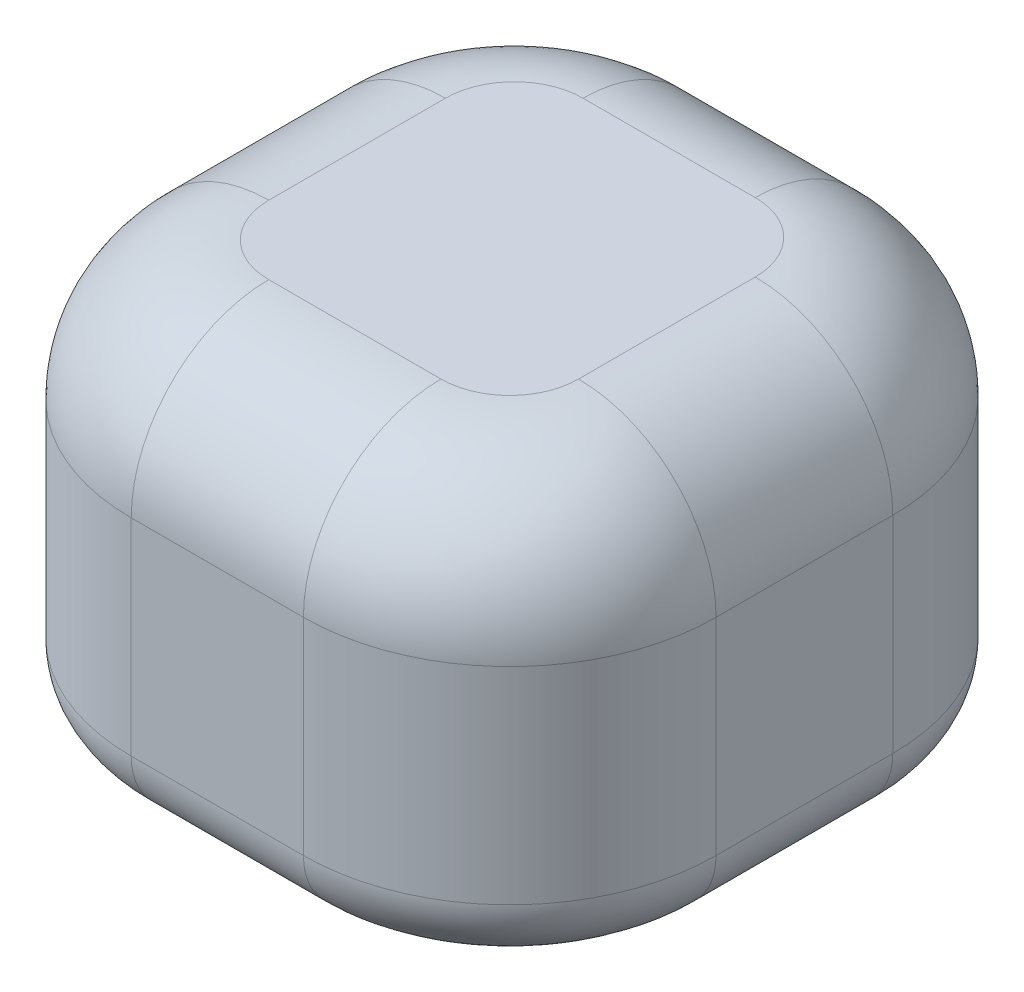
ISO-10303-21;
HEADER;
FILE_DESCRIPTION(('STEP AP214'),'2;1');
FILE_NAME('part.step','',(''),(''),'','','');
FILE_SCHEMA(('AUTOMOTIVE_DESIGN { 1 0 10303 214 1 1 1 1 }'));
ENDSEC;
DATA;
#1=APPLICATION_CONTEXT('core data for automotive mechanical design processes');
#2=APPLICATION_PROTOCOL_DEFINITION('international standard','automotive_design',2000,#1);
#3=PRODUCT_CONTEXT('',#1,'mechanical');
#4=PRODUCT('Part','Part','',(#3));
#5=PRODUCT_RELATED_PRODUCT_CATEGORY('part','',(#4));
#6=PRODUCT_DEFINITION_FORMATION('','',#4);
#7=PRODUCT_DEFINITION_CONTEXT('part definition',#1,'design');
#8=PRODUCT_DEFINITION('design','',#6,#7);
#9=PRODUCT_DEFINITION_SHAPE('','',#8);
#10=(LENGTH_UNIT() NAMED_UNIT(*) SI_UNIT(.MILLI.,.METRE.));
#11=(NAMED_UNIT(*) PLANE_ANGLE_UNIT() SI_UNIT($,.RADIAN.));
#12=(NAMED_UNIT(*) SI_UNIT($,.STERADIAN.) SOLID_ANGLE_UNIT());
#13=UNCERTAINTY_MEASURE_WITH_UNIT(LENGTH_MEASURE(1.E-05),#10,'distance_accuracy_value','');
#14=(GEOMETRIC_REPRESENTATION_CONTEXT(3) GLOBAL_UNCERTAINTY_ASSIGNED_CONTEXT((#13)) GLOBAL_UNIT_ASSIGNED_CONTEXT((#10,
#11,#12)) REPRESENTATION_CONTEXT('',''));
#15=CARTESIAN_POINT('',(0.,0.,0.));
#16=DIRECTION('',(0.,0.,1.));
#17=DIRECTION('',(1.,0.,0.));
#18=AXIS2_PLACEMENT_3D('',#15,#16,#17);
#19=CARTESIAN_POINT('',(42.5199767046538,-30.,42.8475881225822));
#20=DIRECTION('',(1.,0.,0.));
#21=DIRECTION('',(0.,0.,-1.));
#22=AXIS2_PLACEMENT_3D('',#19,#20,#21);
#23=PLANE('',#22);
#24=DIRECTION('',(0.,1.,0.));
#25=VECTOR('',#24,1.);
#26=CARTESIAN_POINT('',(42.5199767046538,-30.,12.8475881225822));
#27=LINE('',#26,#25);
#28=CARTESIAN_POINT('',(42.5199767046538,10.,12.8475881225822));
#29=VERTEX_POINT('',#28);
#30=CARTESIAN_POINT('',(42.5199767046538,-20.,12.8475881225822));
#31=VERTEX_POINT('',#30);
#32=EDGE_CURVE('E293',#29,#31,#27,.F.);
#33=ORIENTED_EDGE('',*,*,#32,.T.);
#34=DIRECTION('',(0.,0.,-1.));
#35=VECTOR('',#34,1.);
#36=CARTESIAN_POINT('',(42.5199767046538,-20.,42.8475881225822));
#37=LINE('',#36,#35);
#38=CARTESIAN_POINT('',(42.5199767046538,-20.,-12.8475881225822));
#39=VERTEX_POINT('',#38);
#40=EDGE_CURVE('E11',#31,#39,#37,.T.);
#41=ORIENTED_EDGE('',*,*,#40,.T.);
#42=DIRECTION('',(0.,1.,0.));
#43=VECTOR('',#42,1.);
#44=CARTESIAN_POINT('',(42.5199767046538,-30.,-12.8475881225822));
#45=LINE('',#44,#43);
#46=CARTESIAN_POINT('',(42.5199767046538,10.,-12.8475881225822));
#47=VERTEX_POINT('',#46);
#48=EDGE_CURVE('E289',#39,#47,#45,.T.);
#49=ORIENTED_EDGE('',*,*,#48,.T.);
#50=DIRECTION('',(0.,0.,-1.));
#51=VECTOR('',#50,1.);
#52=CARTESIAN_POINT('',(42.5199767046538,10.,12.8475881225822));
#53=LINE('',#52,#51);
#54=EDGE_CURVE('E197',#47,#29,#53,.F.);
#55=ORIENTED_EDGE('',*,*,#54,.T.);
#56=EDGE_LOOP('',(#33,#41,#49,#55));
#57=FACE_BOUND('',#56,.T.);
#58=ADVANCED_FACE('F39',(#57),#23,.T.);
#59=CARTESIAN_POINT('',(-42.5199767046538,-30.,42.8475881225822));
#60=DIRECTION('',(0.,0.,1.));
#61=DIRECTION('',(1.,0.,0.));
#62=AXIS2_PLACEMENT_3D('',#59,#60,#61);
#63=PLANE('',#62);
#64=DIRECTION('',(0.,1.,0.));
#65=VECTOR('',#64,1.);
#66=CARTESIAN_POINT('',(-12.5199767046538,-30.,42.8475881225822));
#67=LINE('',#66,#65);
#68=CARTESIAN_POINT('',(-12.5199767046538,10.,42.8475881225822));
#69=VERTEX_POINT('',#68);
#70=CARTESIAN_POINT('',(-12.5199767046538,-20.,42.8475881225822));
#71=VERTEX_POINT('',#70);
#72=EDGE_CURVE('E222',#69,#71,#67,.F.);
#73=ORIENTED_EDGE('',*,*,#72,.T.);
#74=DIRECTION('',(1.,0.,0.));
#75=VECTOR('',#74,1.);
#76=CARTESIAN_POINT('',(-42.5199767046538,-20.,42.8475881225822));
#77=LINE('',#76,#75);
#78=CARTESIAN_POINT('',(12.5199767046538,-20.,42.8475881225822));
#79=VERTEX_POINT('',#78);
#80=EDGE_CURVE('E63',#71,#79,#77,.T.);
#81=ORIENTED_EDGE('',*,*,#80,.T.);
#82=DIRECTION('',(0.,1.,0.));
#83=VECTOR('',#82,1.);
#84=CARTESIAN_POINT('',(12.5199767046538,-30.,42.8475881225822));
#85=LINE('',#84,#83);
#86=CARTESIAN_POINT('',(12.5199767046538,10.,42.8475881225822));
#87=VERTEX_POINT('',#86);
#88=EDGE_CURVE('E287',#79,#87,#85,.T.);
#89=ORIENTED_EDGE('',*,*,#88,.T.);
#90=DIRECTION('',(1.,0.,0.));
#91=VECTOR('',#90,1.);
#92=CARTESIAN_POINT('',(-12.5199767046538,10.,42.8475881225822));
#93=LINE('',#92,#91);
#94=EDGE_CURVE('E202',#87,#69,#93,.F.);
#95=ORIENTED_EDGE('',*,*,#94,.T.);
#96=EDGE_LOOP('',(#73,#81,#89,#95));
#97=FACE_BOUND('',#96,.T.);
#98=ADVANCED_FACE('F286',(#97),#63,.T.);
#99=CARTESIAN_POINT('',(-42.5199767046538,-30.,42.8475881225822));
#100=DIRECTION('',(-1.,0.,0.));
#101=DIRECTION('',(0.,0.,1.));
#102=AXIS2_PLACEMENT_3D('',#99,#100,#101);
#103=PLANE('',#102);
#104=DIRECTION('',(0.,1.,0.));
#105=VECTOR('',#104,1.);
#106=CARTESIAN_POINT('',(-42.5199767046538,-30.,-12.8475881225822));
#107=LINE('',#106,#105);
#108=CARTESIAN_POINT('',(-42.5199767046538,10.,-12.8475881225822));
#109=VERTEX_POINT('',#108);
#110=CARTESIAN_POINT('',(-42.5199767046538,-20.,-12.8475881225822));
#111=VERTEX_POINT('',#110);
#112=EDGE_CURVE('E300',#109,#111,#107,.F.);
#113=ORIENTED_EDGE('',*,*,#112,.T.);
#114=DIRECTION('',(0.,0.,1.));
#115=VECTOR('',#114,1.);
#116=CARTESIAN_POINT('',(-42.5199767046538,-20.,42.8475881225822));
#117=LINE('',#116,#115);
#118=CARTESIAN_POINT('',(-42.5199767046538,-20.,12.8475881225822));
#119=VERTEX_POINT('',#118);
#120=EDGE_CURVE('E246',#111,#119,#117,.T.);
#121=ORIENTED_EDGE('',*,*,#120,.T.);
#122=DIRECTION('',(0.,1.,0.));
#123=VECTOR('',#122,1.);
#124=CARTESIAN_POINT('',(-42.5199767046538,-30.,12.8475881225822));
#125=LINE('',#124,#123);
#126=CARTESIAN_POINT('',(-42.5199767046538,10.,12.8475881225822));
#127=VERTEX_POINT('',#126);
#128=EDGE_CURVE('E175',#119,#127,#125,.T.);
#129=ORIENTED_EDGE('',*,*,#128,.T.);
#130=DIRECTION('',(0.,0.,1.));
#131=VECTOR('',#130,1.);
#132=CARTESIAN_POINT('',(-42.5199767046538,10.,-12.8475881225822));
#133=LINE('',#132,#131);
#134=EDGE_CURVE('E182',#127,#109,#133,.F.);
#135=ORIENTED_EDGE('',*,*,#134,.T.);
#136=EDGE_LOOP('',(#113,#121,#129,#135));
#137=FACE_BOUND('',#136,.T.);
#138=ADVANCED_FACE('F322',(#137),#103,.T.);
#139=CARTESIAN_POINT('',(-42.5199767046538,-30.,-42.8475881225822));
#140=DIRECTION('',(0.,0.,-1.));
#141=DIRECTION('',(-1.,0.,0.));
#142=AXIS2_PLACEMENT_3D('',#139,#140,#141);
#143=PLANE('',#142);
#144=DIRECTION('',(0.,1.,0.));
#145=VECTOR('',#144,1.);
#146=CARTESIAN_POINT('',(12.5199767046538,-30.,-42.8475881225822));
#147=LINE('',#146,#145);
#148=CARTESIAN_POINT('',(12.5199767046538,10.,-42.8475881225822));
#149=VERTEX_POINT('',#148);
#150=CARTESIAN_POINT('',(12.5199767046538,-20.,-42.8475881225822));
#151=VERTEX_POINT('',#150);
#152=EDGE_CURVE('E297',#149,#151,#147,.F.);
#153=ORIENTED_EDGE('',*,*,#152,.T.);
#154=DIRECTION('',(-1.,0.,0.));
#155=VECTOR('',#154,1.);
#156=CARTESIAN_POINT('',(-42.5199767046538,-20.,-42.8475881225822));
#157=LINE('',#156,#155);
#158=CARTESIAN_POINT('',(-12.5199767046538,-20.,-42.8475881225822));
#159=VERTEX_POINT('',#158);
#160=EDGE_CURVE('E242',#151,#159,#157,.T.);
#161=ORIENTED_EDGE('',*,*,#160,.T.);
#162=DIRECTION('',(0.,1.,0.));
#163=VECTOR('',#162,1.);
#164=CARTESIAN_POINT('',(-12.5199767046538,-30.,-42.8475881225822));
#165=LINE('',#164,#163);
#166=CARTESIAN_POINT('',(-12.5199767046538,10.,-42.8475881225822));
#167=VERTEX_POINT('',#166);
#168=EDGE_CURVE('E295',#159,#167,#165,.T.);
#169=ORIENTED_EDGE('',*,*,#168,.T.);
#170=DIRECTION('',(-1.,0.,0.));
#171=VECTOR('',#170,1.);
#172=CARTESIAN_POINT('',(12.5199767046538,10.,-42.8475881225822));
#173=LINE('',#172,#171);
#174=EDGE_CURVE('E192',#167,#149,#173,.F.);
#175=ORIENTED_EDGE('',*,*,#174,.T.);
#176=EDGE_LOOP('',(#153,#161,#169,#175));
#177=FACE_BOUND('',#176,.T.);
#178=ADVANCED_FACE('F376',(#177),#143,.T.);
#179=CARTESIAN_POINT('',(0.,-30.,0.));
#180=DIRECTION('',(0.,-1.,0.));
#181=DIRECTION('',(0.,0.,-1.));
#182=AXIS2_PLACEMENT_3D('',#179,#180,#181);
#183=PLANE('',#182);
#184=DIRECTION('',(-1.,0.,0.));
#185=VECTOR('',#184,1.);
#186=CARTESIAN_POINT('',(0.,-30.,-32.8475881225822));
#187=LINE('',#186,#185);
#188=CARTESIAN_POINT('',(-12.5199767046538,-30.,-32.8475881225822));
#189=VERTEX_POINT('',#188);
#190=CARTESIAN_POINT('',(12.5199767046538,-30.,-32.8475881225822));
#191=VERTEX_POINT('',#190);
#192=EDGE_CURVE('E234',#189,#191,#187,.F.);
#193=ORIENTED_EDGE('',*,*,#192,.T.);
#194=CARTESIAN_POINT('',(12.5199767046538,-30.,-12.8475881225822));
#195=DIRECTION('',(0.,-1.,0.));
#196=DIRECTION('',(0.,0.,-1.));
#197=AXIS2_PLACEMENT_3D('',#194,#195,#196);
#198=CIRCLE('',#197,20.);
#199=CARTESIAN_POINT('',(32.5199767046538,-30.,-12.8475881225822));
#200=VERTEX_POINT('',#199);
#201=EDGE_CURVE('E236',#191,#200,#198,.T.);
#202=ORIENTED_EDGE('',*,*,#201,.T.);
#203=DIRECTION('',(0.,0.,-1.));
#204=VECTOR('',#203,1.);
#205=CARTESIAN_POINT('',(32.5199767046538,-30.,0.));
#206=LINE('',#205,#204);
#207=CARTESIAN_POINT('',(32.5199767046538,-30.,12.8475881225822));
#208=VERTEX_POINT('',#207);
#209=EDGE_CURVE('E203',#200,#208,#206,.F.);
#210=ORIENTED_EDGE('',*,*,#209,.T.);
#211=CARTESIAN_POINT('',(12.5199767046538,-30.,12.8475881225822));
#212=DIRECTION('',(0.,-1.,0.));
#213=DIRECTION('',(0.,0.,-1.));
#214=AXIS2_PLACEMENT_3D('',#211,#212,#213);
#215=CIRCLE('',#214,20.);
#216=CARTESIAN_POINT('',(12.5199767046538,-30.,32.8475881225822));
#217=VERTEX_POINT('',#216);
#218=EDGE_CURVE('E224',#208,#217,#215,.T.);
#219=ORIENTED_EDGE('',*,*,#218,.T.);
#220=DIRECTION('',(1.,0.,0.));
#221=VECTOR('',#220,1.);
#222=CARTESIAN_POINT('',(0.,-30.,32.8475881225822));
#223=LINE('',#222,#221);
#224=CARTESIAN_POINT('',(-12.5199767046538,-30.,32.8475881225822));
#225=VERTEX_POINT('',#224);
#226=EDGE_CURVE('E226',#217,#225,#223,.F.);
#227=ORIENTED_EDGE('',*,*,#226,.T.);
#228=CARTESIAN_POINT('',(-12.5199767046538,-30.,12.8475881225822));
#229=DIRECTION('',(0.,-1.,0.));
#230=DIRECTION('',(0.,0.,-1.));
#231=AXIS2_PLACEMENT_3D('',#228,#229,#230);
#232=CIRCLE('',#231,20.);
#233=CARTESIAN_POINT('',(-32.5199767046538,-30.,12.8475881225822));
#234=VERTEX_POINT('',#233);
#235=EDGE_CURVE('E228',#225,#234,#232,.T.);
#236=ORIENTED_EDGE('',*,*,#235,.T.);
#237=DIRECTION('',(0.,0.,1.));
#238=VECTOR('',#237,1.);
#239=CARTESIAN_POINT('',(-32.5199767046538,-30.,0.));
#240=LINE('',#239,#238);
#241=CARTESIAN_POINT('',(-32.5199767046538,-30.,-12.8475881225822));
#242=VERTEX_POINT('',#241);
#243=EDGE_CURVE('E230',#234,#242,#240,.F.);
#244=ORIENTED_EDGE('',*,*,#243,.T.);
#245=CARTESIAN_POINT('',(-12.5199767046538,-30.,-12.8475881225822));
#246=DIRECTION('',(0.,-1.,0.));
#247=DIRECTION('',(0.,0.,-1.));
#248=AXIS2_PLACEMENT_3D('',#245,#246,#247);
#249=CIRCLE('',#248,20.);
#250=EDGE_CURVE('E232',#242,#189,#249,.T.);
#251=ORIENTED_EDGE('',*,*,#250,.T.);
#252=EDGE_LOOP('',(#193,#202,#210,#219,#227,#236,#244,#251));
#253=FACE_BOUND('',#252,.T.);
#254=ADVANCED_FACE('F339',(#253),#183,.T.);
#255=CARTESIAN_POINT('',(0.,30.,0.));
#256=DIRECTION('',(0.,-1.,0.));
#257=DIRECTION('',(0.,0.,-1.));
#258=AXIS2_PLACEMENT_3D('',#255,#256,#257);
#259=PLANE('',#258);
#260=DIRECTION('',(0.,0.,1.));
#261=VECTOR('',#260,1.);
#262=CARTESIAN_POINT('',(-22.5199767046538,30.,12.8475881225822));
#263=LINE('',#262,#261);
#264=CARTESIAN_POINT('',(-22.5199767046538,30.,-12.8475881225822));
#265=VERTEX_POINT('',#264);
#266=CARTESIAN_POINT('',(-22.5199767046538,30.,12.8475881225822));
#267=VERTEX_POINT('',#266);
#268=EDGE_CURVE('E179',#265,#267,#263,.T.);
#269=ORIENTED_EDGE('',*,*,#268,.T.);
#270=CARTESIAN_POINT('',(-12.5199767046538,30.,12.8475881225822));
#271=DIRECTION('',(0.,-1.,0.));
#272=DIRECTION('',(0.,0.,-1.));
#273=AXIS2_PLACEMENT_3D('',#270,#271,#272);
#274=CIRCLE('',#273,10.);
#275=CARTESIAN_POINT('',(-12.5199767046538,30.,22.8475881225822));
#276=VERTEX_POINT('',#275);
#277=EDGE_CURVE('E160',#267,#276,#274,.F.);
#278=ORIENTED_EDGE('',*,*,#277,.T.);
#279=DIRECTION('',(1.,0.,0.));
#280=VECTOR('',#279,1.);
#281=CARTESIAN_POINT('',(12.5199767046538,30.,22.8475881225822));
#282=LINE('',#281,#280);
#283=CARTESIAN_POINT('',(12.5199767046538,30.,22.8475881225822));
#284=VERTEX_POINT('',#283);
#285=EDGE_CURVE('E168',#276,#284,#282,.T.);
#286=ORIENTED_EDGE('',*,*,#285,.T.);
#287=CARTESIAN_POINT('',(12.5199767046538,30.,12.8475881225822));
#288=DIRECTION('',(0.,-1.,0.));
#289=DIRECTION('',(0.,0.,-1.));
#290=AXIS2_PLACEMENT_3D('',#287,#288,#289);
#291=CIRCLE('',#290,10.);
#292=CARTESIAN_POINT('',(22.5199767046538,30.,12.8475881225822));
#293=VERTEX_POINT('',#292);
#294=EDGE_CURVE('E174',#284,#293,#291,.F.);
#295=ORIENTED_EDGE('',*,*,#294,.T.);
#296=DIRECTION('',(0.,0.,-1.));
#297=VECTOR('',#296,1.);
#298=CARTESIAN_POINT('',(22.5199767046538,30.,-12.8475881225822));
#299=LINE('',#298,#297);
#300=CARTESIAN_POINT('',(22.5199767046538,30.,-12.8475881225822));
#301=VERTEX_POINT('',#300);
#302=EDGE_CURVE('E305',#293,#301,#299,.T.);
#303=ORIENTED_EDGE('',*,*,#302,.T.);
#304=CARTESIAN_POINT('',(12.5199767046538,30.,-12.8475881225822));
#305=DIRECTION('',(0.,-1.,0.));
#306=DIRECTION('',(0.,0.,-1.));
#307=AXIS2_PLACEMENT_3D('',#304,#305,#306);
#308=CIRCLE('',#307,10.);
#309=CARTESIAN_POINT('',(12.5199767046538,30.,-22.8475881225822));
#310=VERTEX_POINT('',#309);
#311=EDGE_CURVE('E307',#301,#310,#308,.F.);
#312=ORIENTED_EDGE('',*,*,#311,.T.);
#313=DIRECTION('',(-1.,0.,0.));
#314=VECTOR('',#313,1.);
#315=CARTESIAN_POINT('',(-12.5199767046538,30.,-22.8475881225822));
#316=LINE('',#315,#314);
#317=CARTESIAN_POINT('',(-12.5199767046538,30.,-22.8475881225822));
#318=VERTEX_POINT('',#317);
#319=EDGE_CURVE('E309',#310,#318,#316,.T.);
#320=ORIENTED_EDGE('',*,*,#319,.T.);
#321=CARTESIAN_POINT('',(-12.5199767046538,30.,-12.8475881225822));
#322=DIRECTION('',(0.,-1.,0.));
#323=DIRECTION('',(0.,0.,-1.));
#324=AXIS2_PLACEMENT_3D('',#321,#322,#323);
#325=CIRCLE('',#324,10.);
#326=EDGE_CURVE('E184',#318,#265,#325,.F.);
#327=ORIENTED_EDGE('',*,*,#326,.T.);
#328=EDGE_LOOP('',(#269,#278,#286,#295,#303,#312,#320,#327));
#329=FACE_BOUND('',#328,.T.);
#330=ADVANCED_FACE('F177',(#329),#259,.F.);
#331=CARTESIAN_POINT('',(12.5199767046538,-30.,12.8475881225822));
#332=DIRECTION('',(0.,1.,0.));
#333=DIRECTION('',(0.,0.,1.));
#334=AXIS2_PLACEMENT_3D('',#331,#332,#333);
#335=CYLINDRICAL_SURFACE('',#334,30.);
#336=ORIENTED_EDGE('',*,*,#88,.F.);
#337=CARTESIAN_POINT('',(12.5199767046538,-20.,12.8475881225822));
#338=DIRECTION('',(0.,-1.,0.));
#339=DIRECTION('',(0.,0.,-1.));
#340=AXIS2_PLACEMENT_3D('',#337,#338,#339);
#341=CIRCLE('',#340,30.);
#342=EDGE_CURVE('E48',#79,#31,#341,.F.);
#343=ORIENTED_EDGE('',*,*,#342,.T.);
#344=ORIENTED_EDGE('',*,*,#32,.F.);
#345=CARTESIAN_POINT('',(12.5199767046538,10.,12.8475881225822));
#346=DIRECTION('',(0.,-1.,0.));
#347=DIRECTION('',(0.,0.,-1.));
#348=AXIS2_PLACEMENT_3D('',#345,#346,#347);
#349=CIRCLE('',#348,30.);
#350=EDGE_CURVE('E199',#29,#87,#349,.T.);
#351=ORIENTED_EDGE('',*,*,#350,.T.);
#352=EDGE_LOOP('',(#336,#343,#344,#351));
#353=FACE_BOUND('',#352,.T.);
#354=ADVANCED_FACE('F378',(#353),#335,.T.);
#355=CARTESIAN_POINT('',(12.5199767046538,-30.,-12.8475881225822));
#356=DIRECTION('',(0.,1.,0.));
#357=DIRECTION('',(0.,0.,1.));
#358=AXIS2_PLACEMENT_3D('',#355,#356,#357);
#359=CYLINDRICAL_SURFACE('',#358,30.);
#360=ORIENTED_EDGE('',*,*,#48,.F.);
#361=CARTESIAN_POINT('',(12.5199767046538,-20.,-12.8475881225822));
#362=DIRECTION('',(0.,-1.,0.));
#363=DIRECTION('',(0.,0.,-1.));
#364=AXIS2_PLACEMENT_3D('',#361,#362,#363);
#365=CIRCLE('',#364,30.);
#366=EDGE_CURVE('E239',#39,#151,#365,.F.);
#367=ORIENTED_EDGE('',*,*,#366,.T.);
#368=ORIENTED_EDGE('',*,*,#152,.F.);
#369=CARTESIAN_POINT('',(12.5199767046538,10.,-12.8475881225822));
#370=DIRECTION('',(0.,-1.,0.));
#371=DIRECTION('',(0.,0.,-1.));
#372=AXIS2_PLACEMENT_3D('',#369,#370,#371);
#373=CIRCLE('',#372,30.);
#374=EDGE_CURVE('E194',#149,#47,#373,.T.);
#375=ORIENTED_EDGE('',*,*,#374,.T.);
#376=EDGE_LOOP('',(#360,#367,#368,#375));
#377=FACE_BOUND('',#376,.T.);
#378=ADVANCED_FACE('F355',(#377),#359,.T.);
#379=CARTESIAN_POINT('',(-12.5199767046538,-30.,12.8475881225822));
#380=DIRECTION('',(0.,1.,0.));
#381=DIRECTION('',(0.,0.,1.));
#382=AXIS2_PLACEMENT_3D('',#379,#380,#381);
#383=CYLINDRICAL_SURFACE('',#382,30.);
#384=ORIENTED_EDGE('',*,*,#128,.F.);
#385=CARTESIAN_POINT('',(-12.5199767046538,-20.,12.8475881225822));
#386=DIRECTION('',(0.,-1.,0.));
#387=DIRECTION('',(0.,0.,-1.));
#388=AXIS2_PLACEMENT_3D('',#385,#386,#387);
#389=CIRCLE('',#388,30.);
#390=EDGE_CURVE('E248',#119,#71,#389,.F.);
#391=ORIENTED_EDGE('',*,*,#390,.T.);
#392=ORIENTED_EDGE('',*,*,#72,.F.);
#393=CARTESIAN_POINT('',(-12.5199767046538,10.,12.8475881225822));
#394=DIRECTION('',(0.,-1.,0.));
#395=DIRECTION('',(0.,0.,-1.));
#396=AXIS2_PLACEMENT_3D('',#393,#394,#395);
#397=CIRCLE('',#396,30.);
#398=EDGE_CURVE('E162',#69,#127,#397,.T.);
#399=ORIENTED_EDGE('',*,*,#398,.T.);
#400=EDGE_LOOP('',(#384,#391,#392,#399));
#401=FACE_BOUND('',#400,.T.);
#402=ADVANCED_FACE('F285',(#401),#383,.T.);
#403=CARTESIAN_POINT('',(-12.5199767046538,-30.,-12.8475881225822));
#404=DIRECTION('',(0.,1.,0.));
#405=DIRECTION('',(0.,0.,1.));
#406=AXIS2_PLACEMENT_3D('',#403,#404,#405);
#407=CYLINDRICAL_SURFACE('',#406,30.);
#408=ORIENTED_EDGE('',*,*,#168,.F.);
#409=CARTESIAN_POINT('',(-12.5199767046538,-20.,-12.8475881225822));
#410=DIRECTION('',(0.,-1.,0.));
#411=DIRECTION('',(0.,0.,-1.));
#412=AXIS2_PLACEMENT_3D('',#409,#410,#411);
#413=CIRCLE('',#412,30.);
#414=EDGE_CURVE('E244',#159,#111,#413,.F.);
#415=ORIENTED_EDGE('',*,*,#414,.T.);
#416=ORIENTED_EDGE('',*,*,#112,.F.);
#417=CARTESIAN_POINT('',(-12.5199767046538,10.,-12.8475881225822));
#418=DIRECTION('',(0.,-1.,0.));
#419=DIRECTION('',(0.,0.,-1.));
#420=AXIS2_PLACEMENT_3D('',#417,#418,#419);
#421=CIRCLE('',#420,30.);
#422=EDGE_CURVE('E189',#109,#167,#421,.T.);
#423=ORIENTED_EDGE('',*,*,#422,.T.);
#424=EDGE_LOOP('',(#408,#415,#416,#423));
#425=FACE_BOUND('',#424,.T.);
#426=ADVANCED_FACE('F325',(#425),#407,.T.);
#427=CARTESIAN_POINT('',(12.5199767046538,10.,-12.8475881225822));
#428=DIRECTION('',(0.,-1.,0.));
#429=DIRECTION('',(0.,0.,-1.));
#430=AXIS2_PLACEMENT_3D('',#427,#428,#429);
#431=DEGENERATE_TOROIDAL_SURFACE('',#430,10.,20.,.T.);
#432=CARTESIAN_POINT('',(22.5199767046538,10.,-12.8475881225822));
#433=DIRECTION('',(0.,0.,1.));
#434=DIRECTION('',(1.,0.,0.));
#435=AXIS2_PLACEMENT_3D('',#432,#433,#434);
#436=CIRCLE('',#435,20.);
#437=EDGE_CURVE('E216',#47,#301,#436,.T.);
#438=ORIENTED_EDGE('',*,*,#437,.F.);
#439=ORIENTED_EDGE('',*,*,#374,.F.);
#440=CARTESIAN_POINT('',(12.5199767046538,10.,-22.8475881225822));
#441=DIRECTION('',(-1.,0.,0.));
#442=DIRECTION('',(0.,0.,1.));
#443=AXIS2_PLACEMENT_3D('',#440,#441,#442);
#444=CIRCLE('',#443,20.);
#445=EDGE_CURVE('E219',#310,#149,#444,.T.);
#446=ORIENTED_EDGE('',*,*,#445,.F.);
#447=ORIENTED_EDGE('',*,*,#311,.F.);
#448=EDGE_LOOP('',(#438,#439,#446,#447));
#449=FACE_BOUND('',#448,.T.);
#450=ADVANCED_FACE('F387',(#449),#431,.T.);
#451=CARTESIAN_POINT('',(0.,10.,-22.8475881225822));
#452=DIRECTION('',(1.,0.,0.));
#453=DIRECTION('',(0.,0.,-1.));
#454=AXIS2_PLACEMENT_3D('',#451,#452,#453);
#455=CYLINDRICAL_SURFACE('',#454,20.);
#456=ORIENTED_EDGE('',*,*,#445,.T.);
#457=ORIENTED_EDGE('',*,*,#174,.F.);
#458=CARTESIAN_POINT('',(-12.5199767046538,10.,-22.8475881225822));
#459=DIRECTION('',(-1.,0.,0.));
#460=DIRECTION('',(0.,0.,1.));
#461=AXIS2_PLACEMENT_3D('',#458,#459,#460);
#462=CIRCLE('',#461,20.);
#463=EDGE_CURVE('E213',#318,#167,#462,.T.);
#464=ORIENTED_EDGE('',*,*,#463,.F.);
#465=ORIENTED_EDGE('',*,*,#319,.F.);
#466=EDGE_LOOP('',(#456,#457,#464,#465));
#467=FACE_BOUND('',#466,.T.);
#468=ADVANCED_FACE('F403',(#467),#455,.T.);
#469=CARTESIAN_POINT('',(22.5199767046538,10.,0.));
#470=DIRECTION('',(0.,0.,1.));
#471=DIRECTION('',(1.,0.,0.));
#472=AXIS2_PLACEMENT_3D('',#469,#470,#471);
#473=CYLINDRICAL_SURFACE('',#472,20.);
#474=ORIENTED_EDGE('',*,*,#437,.T.);
#475=ORIENTED_EDGE('',*,*,#302,.F.);
#476=CARTESIAN_POINT('',(22.5199767046538,10.,12.8475881225822));
#477=DIRECTION('',(0.,0.,1.));
#478=DIRECTION('',(1.,0.,0.));
#479=AXIS2_PLACEMENT_3D('',#476,#477,#478);
#480=CIRCLE('',#479,20.);
#481=EDGE_CURVE('E210',#29,#293,#480,.T.);
#482=ORIENTED_EDGE('',*,*,#481,.F.);
#483=ORIENTED_EDGE('',*,*,#54,.F.);
#484=EDGE_LOOP('',(#474,#475,#482,#483));
#485=FACE_BOUND('',#484,.T.);
#486=ADVANCED_FACE('F400',(#485),#473,.T.);
#487=CARTESIAN_POINT('',(-12.5199767046538,10.,-12.8475881225822));
#488=DIRECTION('',(0.,-1.,0.));
#489=DIRECTION('',(0.,0.,-1.));
#490=AXIS2_PLACEMENT_3D('',#487,#488,#489);
#491=DEGENERATE_TOROIDAL_SURFACE('',#490,10.,20.,.T.);
#492=ORIENTED_EDGE('',*,*,#463,.T.);
#493=ORIENTED_EDGE('',*,*,#422,.F.);
#494=CARTESIAN_POINT('',(-22.5199767046538,10.,-12.8475881225822));
#495=DIRECTION('',(0.,0.,1.));
#496=DIRECTION('',(1.,0.,0.));
#497=AXIS2_PLACEMENT_3D('',#494,#495,#496);
#498=CIRCLE('',#497,20.);
#499=EDGE_CURVE('E207',#265,#109,#498,.T.);
#500=ORIENTED_EDGE('',*,*,#499,.F.);
#501=ORIENTED_EDGE('',*,*,#326,.F.);
#502=EDGE_LOOP('',(#492,#493,#500,#501));
#503=FACE_BOUND('',#502,.T.);
#504=ADVANCED_FACE('F316',(#503),#491,.T.);
#505=CARTESIAN_POINT('',(12.5199767046538,10.,12.8475881225822));
#506=DIRECTION('',(0.,-1.,0.));
#507=DIRECTION('',(0.,0.,-1.));
#508=AXIS2_PLACEMENT_3D('',#505,#506,#507);
#509=DEGENERATE_TOROIDAL_SURFACE('',#508,10.,20.,.T.);
#510=ORIENTED_EDGE('',*,*,#481,.T.);
#511=ORIENTED_EDGE('',*,*,#294,.F.);
#512=CARTESIAN_POINT('',(12.5199767046538,10.,22.8475881225822));
#513=DIRECTION('',(-1.,0.,0.));
#514=DIRECTION('',(0.,0.,1.));
#515=AXIS2_PLACEMENT_3D('',#512,#513,#514);
#516=CIRCLE('',#515,20.);
#517=EDGE_CURVE('E171',#87,#284,#516,.T.);
#518=ORIENTED_EDGE('',*,*,#517,.F.);
#519=ORIENTED_EDGE('',*,*,#350,.F.);
#520=EDGE_LOOP('',(#510,#511,#518,#519));
#521=FACE_BOUND('',#520,.T.);
#522=ADVANCED_FACE('F394',(#521),#509,.T.);
#523=CARTESIAN_POINT('',(-22.5199767046538,10.,0.));
#524=DIRECTION('',(0.,0.,-1.));
#525=DIRECTION('',(-1.,0.,0.));
#526=AXIS2_PLACEMENT_3D('',#523,#524,#525);
#527=CYLINDRICAL_SURFACE('',#526,20.);
#528=ORIENTED_EDGE('',*,*,#499,.T.);
#529=ORIENTED_EDGE('',*,*,#134,.F.);
#530=CARTESIAN_POINT('',(-22.5199767046538,10.,12.8475881225822));
#531=DIRECTION('',(0.,0.,1.));
#532=DIRECTION('',(1.,0.,0.));
#533=AXIS2_PLACEMENT_3D('',#530,#531,#532);
#534=CIRCLE('',#533,20.);
#535=EDGE_CURVE('E165',#267,#127,#534,.T.);
#536=ORIENTED_EDGE('',*,*,#535,.F.);
#537=ORIENTED_EDGE('',*,*,#268,.F.);
#538=EDGE_LOOP('',(#528,#529,#536,#537));
#539=FACE_BOUND('',#538,.T.);
#540=ADVANCED_FACE('F319',(#539),#527,.T.);
#541=CARTESIAN_POINT('',(0.,10.,22.8475881225822));
#542=DIRECTION('',(-1.,0.,0.));
#543=DIRECTION('',(0.,0.,1.));
#544=AXIS2_PLACEMENT_3D('',#541,#542,#543);
#545=CYLINDRICAL_SURFACE('',#544,20.);
#546=ORIENTED_EDGE('',*,*,#517,.T.);
#547=ORIENTED_EDGE('',*,*,#285,.F.);
#548=CARTESIAN_POINT('',(-12.5199767046538,10.,22.8475881225822));
#549=DIRECTION('',(-1.,0.,0.));
#550=DIRECTION('',(0.,0.,1.));
#551=AXIS2_PLACEMENT_3D('',#548,#549,#550);
#552=CIRCLE('',#551,20.);
#553=EDGE_CURVE('E155',#69,#276,#552,.T.);
#554=ORIENTED_EDGE('',*,*,#553,.F.);
#555=ORIENTED_EDGE('',*,*,#94,.F.);
#556=EDGE_LOOP('',(#546,#547,#554,#555));
#557=FACE_BOUND('',#556,.T.);
#558=ADVANCED_FACE('F169',(#557),#545,.T.);
#559=CARTESIAN_POINT('',(-12.5199767046538,10.,12.8475881225822));
#560=DIRECTION('',(0.,-1.,0.));
#561=DIRECTION('',(0.,0.,-1.));
#562=AXIS2_PLACEMENT_3D('',#559,#560,#561);
#563=DEGENERATE_TOROIDAL_SURFACE('',#562,10.,20.,.T.);
#564=ORIENTED_EDGE('',*,*,#535,.T.);
#565=ORIENTED_EDGE('',*,*,#398,.F.);
#566=ORIENTED_EDGE('',*,*,#553,.T.);
#567=ORIENTED_EDGE('',*,*,#277,.F.);
#568=EDGE_LOOP('',(#564,#565,#566,#567));
#569=FACE_BOUND('',#568,.T.);
#570=ADVANCED_FACE('F158',(#569),#563,.T.);
#571=CARTESIAN_POINT('',(-12.5199767046538,-20.,12.8475881225822));
#572=DIRECTION('',(0.,-1.,0.));
#573=DIRECTION('',(0.,0.,-1.));
#574=AXIS2_PLACEMENT_3D('',#571,#572,#573);
#575=TOROIDAL_SURFACE('',#574,20.,10.);
#576=CARTESIAN_POINT('',(-12.5199767046538,-20.,32.8475881225822));
#577=DIRECTION('',(1.,0.,0.));
#578=DIRECTION('',(0.,0.,-1.));
#579=AXIS2_PLACEMENT_3D('',#576,#577,#578);
#580=CIRCLE('',#579,10.);
#581=EDGE_CURVE('E267',#71,#225,#580,.T.);
#582=ORIENTED_EDGE('',*,*,#581,.F.);
#583=ORIENTED_EDGE('',*,*,#390,.F.);
#584=CARTESIAN_POINT('',(-32.5199767046538,-20.,12.8475881225822));
#585=DIRECTION('',(0.,0.,-1.));
#586=DIRECTION('',(-1.,0.,0.));
#587=AXIS2_PLACEMENT_3D('',#584,#585,#586);
#588=CIRCLE('',#587,10.);
#589=EDGE_CURVE('E43',#234,#119,#588,.T.);
#590=ORIENTED_EDGE('',*,*,#589,.F.);
#591=ORIENTED_EDGE('',*,*,#235,.F.);
#592=EDGE_LOOP('',(#582,#583,#590,#591));
#593=FACE_BOUND('',#592,.T.);
#594=ADVANCED_FACE('F41',(#593),#575,.T.);
#595=CARTESIAN_POINT('',(-32.5199767046538,-20.,42.8475881225822));
#596=DIRECTION('',(0.,0.,1.));
#597=DIRECTION('',(1.,0.,0.));
#598=AXIS2_PLACEMENT_3D('',#595,#596,#597);
#599=CYLINDRICAL_SURFACE('',#598,10.);
#600=ORIENTED_EDGE('',*,*,#589,.T.);
#601=ORIENTED_EDGE('',*,*,#120,.F.);
#602=CARTESIAN_POINT('',(-32.5199767046538,-20.,-12.8475881225822));
#603=DIRECTION('',(0.,0.,-1.));
#604=DIRECTION('',(-1.,0.,0.));
#605=AXIS2_PLACEMENT_3D('',#602,#603,#604);
#606=CIRCLE('',#605,10.);
#607=EDGE_CURVE('E265',#242,#111,#606,.T.);
#608=ORIENTED_EDGE('',*,*,#607,.F.);
#609=ORIENTED_EDGE('',*,*,#243,.F.);
#610=EDGE_LOOP('',(#600,#601,#608,#609));
#611=FACE_BOUND('',#610,.T.);
#612=ADVANCED_FACE('F277',(#611),#599,.T.);
#613=CARTESIAN_POINT('',(-42.5199767046538,-20.,32.8475881225822));
#614=DIRECTION('',(1.,0.,0.));
#615=DIRECTION('',(0.,0.,-1.));
#616=AXIS2_PLACEMENT_3D('',#613,#614,#615);
#617=CYLINDRICAL_SURFACE('',#616,10.);
#618=ORIENTED_EDGE('',*,*,#581,.T.);
#619=ORIENTED_EDGE('',*,*,#226,.F.);
#620=CARTESIAN_POINT('',(12.5199767046538,-20.,32.8475881225822));
#621=DIRECTION('',(1.,0.,0.));
#622=DIRECTION('',(0.,0.,-1.));
#623=AXIS2_PLACEMENT_3D('',#620,#621,#622);
#624=CIRCLE('',#623,10.);
#625=EDGE_CURVE('E262',#79,#217,#624,.T.);
#626=ORIENTED_EDGE('',*,*,#625,.F.);
#627=ORIENTED_EDGE('',*,*,#80,.F.);
#628=EDGE_LOOP('',(#618,#619,#626,#627));
#629=FACE_BOUND('',#628,.T.);
#630=ADVANCED_FACE('F342',(#629),#617,.T.);
#631=CARTESIAN_POINT('',(-12.5199767046538,-20.,-12.8475881225822));
#632=DIRECTION('',(0.,-1.,0.));
#633=DIRECTION('',(0.,0.,-1.));
#634=AXIS2_PLACEMENT_3D('',#631,#632,#633);
#635=TOROIDAL_SURFACE('',#634,20.,10.);
#636=ORIENTED_EDGE('',*,*,#607,.T.);
#637=ORIENTED_EDGE('',*,*,#414,.F.);
#638=CARTESIAN_POINT('',(-12.5199767046538,-20.,-32.8475881225822));
#639=DIRECTION('',(1.,0.,0.));
#640=DIRECTION('',(0.,0.,-1.));
#641=AXIS2_PLACEMENT_3D('',#638,#639,#640);
#642=CIRCLE('',#641,10.);
#643=EDGE_CURVE('E259',#189,#159,#642,.T.);
#644=ORIENTED_EDGE('',*,*,#643,.F.);
#645=ORIENTED_EDGE('',*,*,#250,.F.);
#646=EDGE_LOOP('',(#636,#637,#644,#645));
#647=FACE_BOUND('',#646,.T.);
#648=ADVANCED_FACE('F330',(#647),#635,.T.);
#649=CARTESIAN_POINT('',(12.5199767046538,-20.,12.8475881225822));
#650=DIRECTION('',(0.,-1.,0.));
#651=DIRECTION('',(0.,0.,-1.));
#652=AXIS2_PLACEMENT_3D('',#649,#650,#651);
#653=TOROIDAL_SURFACE('',#652,20.,10.);
#654=ORIENTED_EDGE('',*,*,#625,.T.);
#655=ORIENTED_EDGE('',*,*,#218,.F.);
#656=CARTESIAN_POINT('',(32.5199767046538,-20.,12.8475881225822));
#657=DIRECTION('',(0.,0.,-1.));
#658=DIRECTION('',(-1.,0.,0.));
#659=AXIS2_PLACEMENT_3D('',#656,#657,#658);
#660=CIRCLE('',#659,10.);
#661=EDGE_CURVE('E256',#31,#208,#660,.T.);
#662=ORIENTED_EDGE('',*,*,#661,.F.);
#663=ORIENTED_EDGE('',*,*,#342,.F.);
#664=EDGE_LOOP('',(#654,#655,#662,#663));
#665=FACE_BOUND('',#664,.T.);
#666=ADVANCED_FACE('F344',(#665),#653,.T.);
#667=CARTESIAN_POINT('',(-42.5199767046538,-20.,-32.8475881225822));
#668=DIRECTION('',(-1.,0.,0.));
#669=DIRECTION('',(0.,0.,1.));
#670=AXIS2_PLACEMENT_3D('',#667,#668,#669);
#671=CYLINDRICAL_SURFACE('',#670,10.);
#672=ORIENTED_EDGE('',*,*,#643,.T.);
#673=ORIENTED_EDGE('',*,*,#160,.F.);
#674=CARTESIAN_POINT('',(12.5199767046538,-20.,-32.8475881225822));
#675=DIRECTION('',(1.,0.,0.));
#676=DIRECTION('',(0.,0.,-1.));
#677=AXIS2_PLACEMENT_3D('',#674,#675,#676);
#678=CIRCLE('',#677,10.);
#679=EDGE_CURVE('E254',#191,#151,#678,.T.);
#680=ORIENTED_EDGE('',*,*,#679,.F.);
#681=ORIENTED_EDGE('',*,*,#192,.F.);
#682=EDGE_LOOP('',(#672,#673,#680,#681));
#683=FACE_BOUND('',#682,.T.);
#684=ADVANCED_FACE('F335',(#683),#671,.T.);
#685=CARTESIAN_POINT('',(32.5199767046538,-20.,42.8475881225822));
#686=DIRECTION('',(0.,0.,-1.));
#687=DIRECTION('',(-1.,0.,0.));
#688=AXIS2_PLACEMENT_3D('',#685,#686,#687);
#689=CYLINDRICAL_SURFACE('',#688,10.);
#690=ORIENTED_EDGE('',*,*,#661,.T.);
#691=ORIENTED_EDGE('',*,*,#209,.F.);
#692=CARTESIAN_POINT('',(32.5199767046538,-20.,-12.8475881225822));
#693=DIRECTION('',(0.,0.,-1.));
#694=DIRECTION('',(-1.,0.,0.));
#695=AXIS2_PLACEMENT_3D('',#692,#693,#694);
#696=CIRCLE('',#695,10.);
#697=EDGE_CURVE('E252',#39,#200,#696,.T.);
#698=ORIENTED_EDGE('',*,*,#697,.F.);
#699=ORIENTED_EDGE('',*,*,#40,.F.);
#700=EDGE_LOOP('',(#690,#691,#698,#699));
#701=FACE_BOUND('',#700,.T.);
#702=ADVANCED_FACE('F350',(#701),#689,.T.);
#703=CARTESIAN_POINT('',(12.5199767046538,-20.,-12.8475881225822));
#704=DIRECTION('',(0.,-1.,0.));
#705=DIRECTION('',(0.,0.,-1.));
#706=AXIS2_PLACEMENT_3D('',#703,#704,#705);
#707=TOROIDAL_SURFACE('',#706,20.,10.);
#708=ORIENTED_EDGE('',*,*,#679,.T.);
#709=ORIENTED_EDGE('',*,*,#366,.F.);
#710=ORIENTED_EDGE('',*,*,#697,.T.);
#711=ORIENTED_EDGE('',*,*,#201,.F.);
#712=EDGE_LOOP('',(#708,#709,#710,#711));
#713=FACE_BOUND('',#712,.T.);
#714=ADVANCED_FACE('F360',(#713),#707,.T.);
#715=CLOSED_SHELL('',(#58,#98,#138,#178,#254,#330,#354,#378,#402,#426,#450,#468,#486,#504,#522,
#540,#558,#570,#594,#612,#630,#648,#666,#684,#702,#714));
#716=MANIFOLD_SOLID_BREP('B2',#715);
#717=ADVANCED_BREP_SHAPE_REPRESENTATION('',(#18,#716),#14);
#718=SHAPE_DEFINITION_REPRESENTATION(#9,#717);
ENDSEC;
END-ISO-10303-21;
